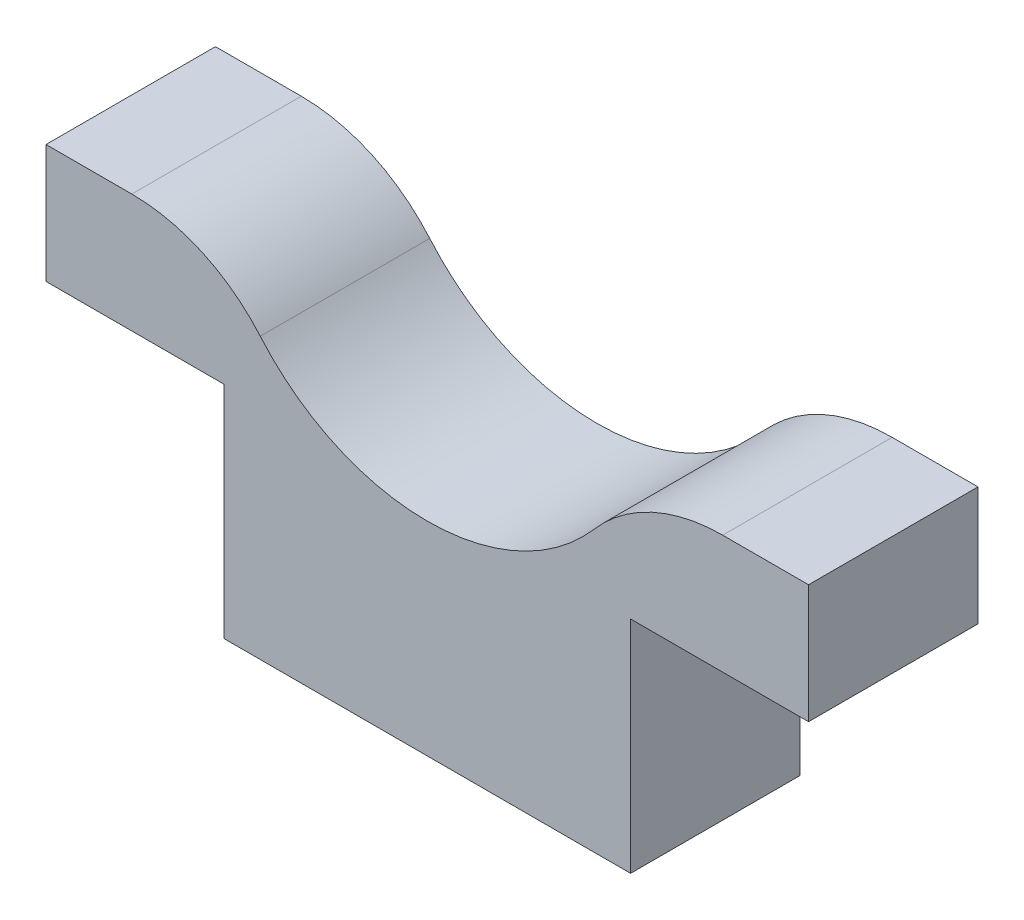
ISO-10303-21;
HEADER;
FILE_DESCRIPTION(('STEP AP214'),'2;1');
FILE_NAME('part.step','',(''),(''),'','','');
FILE_SCHEMA(('AUTOMOTIVE_DESIGN { 1 0 10303 214 1 1 1 1 }'));
ENDSEC;
DATA;
#1=APPLICATION_CONTEXT('core data for automotive mechanical design processes');
#2=APPLICATION_PROTOCOL_DEFINITION('international standard','automotive_design',2000,#1);
#3=PRODUCT_CONTEXT('',#1,'mechanical');
#4=PRODUCT('Part','Part','',(#3));
#5=PRODUCT_RELATED_PRODUCT_CATEGORY('part','',(#4));
#6=PRODUCT_DEFINITION_FORMATION('','',#4);
#7=PRODUCT_DEFINITION_CONTEXT('part definition',#1,'design');
#8=PRODUCT_DEFINITION('design','',#6,#7);
#9=PRODUCT_DEFINITION_SHAPE('','',#8);
#10=(LENGTH_UNIT() NAMED_UNIT(*) SI_UNIT(.MILLI.,.METRE.));
#11=(NAMED_UNIT(*) PLANE_ANGLE_UNIT() SI_UNIT($,.RADIAN.));
#12=(NAMED_UNIT(*) SI_UNIT($,.STERADIAN.) SOLID_ANGLE_UNIT());
#13=UNCERTAINTY_MEASURE_WITH_UNIT(LENGTH_MEASURE(1.E-05),#10,'distance_accuracy_value','');
#14=(GEOMETRIC_REPRESENTATION_CONTEXT(3) GLOBAL_UNCERTAINTY_ASSIGNED_CONTEXT((#13)) GLOBAL_UNIT_ASSIGNED_CONTEXT((#10,
#11,#12)) REPRESENTATION_CONTEXT('',''));
#15=CARTESIAN_POINT('',(0.,0.,0.));
#16=DIRECTION('',(0.,0.,1.));
#17=DIRECTION('',(1.,0.,0.));
#18=AXIS2_PLACEMENT_3D('',#15,#16,#17);
#19=CARTESIAN_POINT('',(0.,20.,10.));
#20=DIRECTION('',(0.,1.,0.));
#21=DIRECTION('',(0.,0.,1.));
#22=AXIS2_PLACEMENT_3D('',#19,#20,#21);
#23=PLANE('',#22);
#24=DIRECTION('',(1.,0.,0.));
#25=VECTOR('',#24,1.);
#26=CARTESIAN_POINT('',(0.,20.,0.));
#27=LINE('',#26,#25);
#28=CARTESIAN_POINT('',(29.4355957741627,20.,0.));
#29=VERTEX_POINT('',#28);
#30=CARTESIAN_POINT('',(34.5,20.,0.));
#31=VERTEX_POINT('',#30);
#32=EDGE_CURVE('E212',#29,#31,#27,.T.);
#33=ORIENTED_EDGE('',*,*,#32,.F.);
#34=DIRECTION('',(0.,0.,1.));
#35=VECTOR('',#34,1.);
#36=CARTESIAN_POINT('',(29.4355957741627,20.,10.));
#37=LINE('',#36,#35);
#38=CARTESIAN_POINT('',(29.4355957741627,20.,10.));
#39=VERTEX_POINT('',#38);
#40=EDGE_CURVE('E11',#29,#39,#37,.T.);
#41=ORIENTED_EDGE('',*,*,#40,.T.);
#42=DIRECTION('',(1.,0.,0.));
#43=VECTOR('',#42,1.);
#44=CARTESIAN_POINT('',(0.,20.,10.));
#45=LINE('',#44,#43);
#46=CARTESIAN_POINT('',(34.5,20.,10.));
#47=VERTEX_POINT('',#46);
#48=EDGE_CURVE('E181',#39,#47,#45,.T.);
#49=ORIENTED_EDGE('',*,*,#48,.T.);
#50=DIRECTION('',(0.,0.,-1.));
#51=VECTOR('',#50,1.);
#52=CARTESIAN_POINT('',(34.5,20.,10.));
#53=LINE('',#52,#51);
#54=EDGE_CURVE('E224',#47,#31,#53,.T.);
#55=ORIENTED_EDGE('',*,*,#54,.T.);
#56=EDGE_LOOP('',(#33,#41,#49,#55));
#57=FACE_BOUND('',#56,.T.);
#58=ADVANCED_FACE('F35',(#57),#23,.T.);
#59=CARTESIAN_POINT('',(0.,0.,10.));
#60=DIRECTION('',(0.,1.,0.));
#61=DIRECTION('',(0.,0.,1.));
#62=AXIS2_PLACEMENT_3D('',#59,#60,#61);
#63=PLANE('',#62);
#64=DIRECTION('',(1.,0.,0.));
#65=VECTOR('',#64,1.);
#66=CARTESIAN_POINT('',(0.,0.,0.));
#67=LINE('',#66,#65);
#68=CARTESIAN_POINT('',(0.,0.,0.));
#69=VERTEX_POINT('',#68);
#70=CARTESIAN_POINT('',(24.,0.,0.));
#71=VERTEX_POINT('',#70);
#72=EDGE_CURVE('E148',#69,#71,#67,.T.);
#73=ORIENTED_EDGE('',*,*,#72,.T.);
#74=DIRECTION('',(0.,0.,-1.));
#75=VECTOR('',#74,1.);
#76=CARTESIAN_POINT('',(24.,0.,10.));
#77=LINE('',#76,#75);
#78=CARTESIAN_POINT('',(24.,0.,10.));
#79=VERTEX_POINT('',#78);
#80=EDGE_CURVE('E129',#79,#71,#77,.T.);
#81=ORIENTED_EDGE('',*,*,#80,.F.);
#82=DIRECTION('',(1.,0.,0.));
#83=VECTOR('',#82,1.);
#84=CARTESIAN_POINT('',(0.,0.,10.));
#85=LINE('',#84,#83);
#86=CARTESIAN_POINT('',(0.,0.,10.));
#87=VERTEX_POINT('',#86);
#88=EDGE_CURVE('E136',#87,#79,#85,.T.);
#89=ORIENTED_EDGE('',*,*,#88,.F.);
#90=DIRECTION('',(0.,0.,-1.));
#91=VECTOR('',#90,1.);
#92=CARTESIAN_POINT('',(0.,0.,10.));
#93=LINE('',#92,#91);
#94=EDGE_CURVE('E202',#87,#69,#93,.T.);
#95=ORIENTED_EDGE('',*,*,#94,.T.);
#96=EDGE_LOOP('',(#73,#81,#89,#95));
#97=FACE_BOUND('',#96,.T.);
#98=ADVANCED_FACE('F146',(#97),#63,.F.);
#99=CARTESIAN_POINT('',(24.,0.,10.));
#100=DIRECTION('',(-1.,0.,0.));
#101=DIRECTION('',(0.,0.,1.));
#102=AXIS2_PLACEMENT_3D('',#99,#100,#101);
#103=PLANE('',#102);
#104=DIRECTION('',(0.,1.,0.));
#105=VECTOR('',#104,1.);
#106=CARTESIAN_POINT('',(24.,0.,0.));
#107=LINE('',#106,#105);
#108=CARTESIAN_POINT('',(24.,13.,0.));
#109=VERTEX_POINT('',#108);
#110=EDGE_CURVE('E204',#71,#109,#107,.T.);
#111=ORIENTED_EDGE('',*,*,#110,.T.);
#112=DIRECTION('',(0.,0.,-1.));
#113=VECTOR('',#112,1.);
#114=CARTESIAN_POINT('',(24.,13.,10.));
#115=LINE('',#114,#113);
#116=CARTESIAN_POINT('',(24.,13.,10.));
#117=VERTEX_POINT('',#116);
#118=EDGE_CURVE('E132',#117,#109,#115,.T.);
#119=ORIENTED_EDGE('',*,*,#118,.F.);
#120=DIRECTION('',(0.,1.,0.));
#121=VECTOR('',#120,1.);
#122=CARTESIAN_POINT('',(24.,0.,10.));
#123=LINE('',#122,#121);
#124=EDGE_CURVE('E125',#79,#117,#123,.T.);
#125=ORIENTED_EDGE('',*,*,#124,.F.);
#126=ORIENTED_EDGE('',*,*,#80,.T.);
#127=EDGE_LOOP('',(#111,#119,#125,#126));
#128=FACE_BOUND('',#127,.T.);
#129=ADVANCED_FACE('F127',(#128),#103,.F.);
#130=CARTESIAN_POINT('',(0.,13.,10.));
#131=DIRECTION('',(0.,1.,0.));
#132=DIRECTION('',(0.,0.,1.));
#133=AXIS2_PLACEMENT_3D('',#130,#131,#132);
#134=PLANE('',#133);
#135=DIRECTION('',(1.,0.,0.));
#136=VECTOR('',#135,1.);
#137=CARTESIAN_POINT('',(0.,13.,0.));
#138=LINE('',#137,#136);
#139=CARTESIAN_POINT('',(34.5,13.,0.));
#140=VERTEX_POINT('',#139);
#141=EDGE_CURVE('E206',#109,#140,#138,.T.);
#142=ORIENTED_EDGE('',*,*,#141,.T.);
#143=DIRECTION('',(0.,0.,-1.));
#144=VECTOR('',#143,1.);
#145=CARTESIAN_POINT('',(34.5,13.,10.));
#146=LINE('',#145,#144);
#147=CARTESIAN_POINT('',(34.5,13.,10.));
#148=VERTEX_POINT('',#147);
#149=EDGE_CURVE('E154',#148,#140,#146,.T.);
#150=ORIENTED_EDGE('',*,*,#149,.F.);
#151=DIRECTION('',(1.,0.,0.));
#152=VECTOR('',#151,1.);
#153=CARTESIAN_POINT('',(0.,13.,10.));
#154=LINE('',#153,#152);
#155=EDGE_CURVE('E135',#117,#148,#154,.T.);
#156=ORIENTED_EDGE('',*,*,#155,.F.);
#157=ORIENTED_EDGE('',*,*,#118,.T.);
#158=EDGE_LOOP('',(#142,#150,#156,#157));
#159=FACE_BOUND('',#158,.T.);
#160=ADVANCED_FACE('F236',(#159),#134,.F.);
#161=CARTESIAN_POINT('',(34.5,0.,10.));
#162=DIRECTION('',(-1.,0.,0.));
#163=DIRECTION('',(0.,0.,1.));
#164=AXIS2_PLACEMENT_3D('',#161,#162,#163);
#165=PLANE('',#164);
#166=DIRECTION('',(0.,1.,0.));
#167=VECTOR('',#166,1.);
#168=CARTESIAN_POINT('',(34.5,0.,0.));
#169=LINE('',#168,#167);
#170=EDGE_CURVE('E208',#140,#31,#169,.T.);
#171=ORIENTED_EDGE('',*,*,#170,.T.);
#172=ORIENTED_EDGE('',*,*,#54,.F.);
#173=DIRECTION('',(0.,1.,0.));
#174=VECTOR('',#173,1.);
#175=CARTESIAN_POINT('',(34.5,0.,10.));
#176=LINE('',#175,#174);
#177=EDGE_CURVE('E196',#148,#47,#176,.T.);
#178=ORIENTED_EDGE('',*,*,#177,.F.);
#179=ORIENTED_EDGE('',*,*,#149,.T.);
#180=EDGE_LOOP('',(#171,#172,#178,#179));
#181=FACE_BOUND('',#180,.T.);
#182=ADVANCED_FACE('F231',(#181),#165,.F.);
#183=CARTESIAN_POINT('',(-10.5,20.,10.));
#184=VERTEX_POINT('',#183);
#185=CARTESIAN_POINT('',(-5.43559577416268,20.,10.));
#186=VERTEX_POINT('',#185);
#187=EDGE_CURVE('E170',#184,#186,#45,.T.);
#188=ORIENTED_EDGE('',*,*,#187,.T.);
#189=DIRECTION('',(0.,0.,1.));
#190=VECTOR('',#189,1.);
#191=CARTESIAN_POINT('',(-5.43559577416268,20.,0.));
#192=LINE('',#191,#190);
#193=CARTESIAN_POINT('',(-5.43559577416268,20.,0.));
#194=VERTEX_POINT('',#193);
#195=EDGE_CURVE('E149',#186,#194,#192,.F.);
#196=ORIENTED_EDGE('',*,*,#195,.T.);
#197=CARTESIAN_POINT('',(-10.5,20.,0.));
#198=VERTEX_POINT('',#197);
#199=EDGE_CURVE('E189',#198,#194,#27,.T.);
#200=ORIENTED_EDGE('',*,*,#199,.F.);
#201=DIRECTION('',(0.,0.,-1.));
#202=VECTOR('',#201,1.);
#203=CARTESIAN_POINT('',(-10.5,20.,10.));
#204=LINE('',#203,#202);
#205=EDGE_CURVE('E179',#184,#198,#204,.T.);
#206=ORIENTED_EDGE('',*,*,#205,.F.);
#207=EDGE_LOOP('',(#188,#196,#200,#206));
#208=FACE_BOUND('',#207,.T.);
#209=ADVANCED_FACE('F176',(#208),#23,.T.);
#210=CARTESIAN_POINT('',(-10.5,0.,10.));
#211=DIRECTION('',(-1.,0.,0.));
#212=DIRECTION('',(0.,-1.,0.));
#213=AXIS2_PLACEMENT_3D('',#210,#211,#212);
#214=PLANE('',#213);
#215=DIRECTION('',(0.,1.,0.));
#216=VECTOR('',#215,1.);
#217=CARTESIAN_POINT('',(-10.5,0.,0.));
#218=LINE('',#217,#216);
#219=CARTESIAN_POINT('',(-10.5,13.,0.));
#220=VERTEX_POINT('',#219);
#221=EDGE_CURVE('E214',#220,#198,#218,.T.);
#222=ORIENTED_EDGE('',*,*,#221,.F.);
#223=DIRECTION('',(0.,0.,-1.));
#224=VECTOR('',#223,1.);
#225=CARTESIAN_POINT('',(-10.5,13.,10.));
#226=LINE('',#225,#224);
#227=CARTESIAN_POINT('',(-10.5,13.,10.));
#228=VERTEX_POINT('',#227);
#229=EDGE_CURVE('E221',#228,#220,#226,.T.);
#230=ORIENTED_EDGE('',*,*,#229,.F.);
#231=DIRECTION('',(0.,1.,0.));
#232=VECTOR('',#231,1.);
#233=CARTESIAN_POINT('',(-10.5,0.,10.));
#234=LINE('',#233,#232);
#235=EDGE_CURVE('E180',#228,#184,#234,.T.);
#236=ORIENTED_EDGE('',*,*,#235,.T.);
#237=ORIENTED_EDGE('',*,*,#205,.T.);
#238=EDGE_LOOP('',(#222,#230,#236,#237));
#239=FACE_BOUND('',#238,.T.);
#240=ADVANCED_FACE('F250',(#239),#214,.T.);
#241=CARTESIAN_POINT('',(0.,13.,0.));
#242=VERTEX_POINT('',#241);
#243=EDGE_CURVE('E209',#220,#242,#138,.T.);
#244=ORIENTED_EDGE('',*,*,#243,.T.);
#245=DIRECTION('',(0.,0.,-1.));
#246=VECTOR('',#245,1.);
#247=CARTESIAN_POINT('',(0.,13.,10.));
#248=LINE('',#247,#246);
#249=CARTESIAN_POINT('',(0.,13.,10.));
#250=VERTEX_POINT('',#249);
#251=EDGE_CURVE('E219',#250,#242,#248,.T.);
#252=ORIENTED_EDGE('',*,*,#251,.F.);
#253=EDGE_CURVE('E197',#228,#250,#154,.T.);
#254=ORIENTED_EDGE('',*,*,#253,.F.);
#255=ORIENTED_EDGE('',*,*,#229,.T.);
#256=EDGE_LOOP('',(#244,#252,#254,#255));
#257=FACE_BOUND('',#256,.T.);
#258=ADVANCED_FACE('F239',(#257),#134,.F.);
#259=CARTESIAN_POINT('',(0.,0.,10.));
#260=DIRECTION('',(-1.,0.,0.));
#261=DIRECTION('',(0.,0.,1.));
#262=AXIS2_PLACEMENT_3D('',#259,#260,#261);
#263=PLANE('',#262);
#264=DIRECTION('',(0.,1.,0.));
#265=VECTOR('',#264,1.);
#266=CARTESIAN_POINT('',(0.,0.,0.));
#267=LINE('',#266,#265);
#268=EDGE_CURVE('E144',#69,#242,#267,.T.);
#269=ORIENTED_EDGE('',*,*,#268,.F.);
#270=ORIENTED_EDGE('',*,*,#94,.F.);
#271=DIRECTION('',(0.,1.,0.));
#272=VECTOR('',#271,1.);
#273=CARTESIAN_POINT('',(0.,0.,10.));
#274=LINE('',#273,#272);
#275=EDGE_CURVE('E142',#87,#250,#274,.T.);
#276=ORIENTED_EDGE('',*,*,#275,.T.);
#277=ORIENTED_EDGE('',*,*,#251,.T.);
#278=EDGE_LOOP('',(#269,#270,#276,#277));
#279=FACE_BOUND('',#278,.T.);
#280=ADVANCED_FACE('F249',(#279),#263,.T.);
#281=CARTESIAN_POINT('',(0.,0.,10.));
#282=DIRECTION('',(0.,0.,1.));
#283=DIRECTION('',(1.,0.,0.));
#284=AXIS2_PLACEMENT_3D('',#281,#282,#283);
#285=PLANE('',#284);
#286=CARTESIAN_POINT('',(12.,25.,10.));
#287=DIRECTION('',(0.,0.,-1.));
#288=DIRECTION('',(1.,0.,0.));
#289=AXIS2_PLACEMENT_3D('',#286,#287,#288);
#290=CIRCLE('',#289,13.);
#291=CARTESIAN_POINT('',(21.8549019593094,16.5217391304348,10.));
#292=VERTEX_POINT('',#291);
#293=CARTESIAN_POINT('',(2.14509804069066,16.5217391304348,10.));
#294=VERTEX_POINT('',#293);
#295=EDGE_CURVE('E172',#292,#294,#290,.T.);
#296=ORIENTED_EDGE('',*,*,#295,.T.);
#297=CARTESIAN_POINT('',(-5.43559577416268,10.,10.));
#298=DIRECTION('',(0.,0.,1.));
#299=DIRECTION('',(1.,0.,0.));
#300=AXIS2_PLACEMENT_3D('',#297,#298,#299);
#301=CIRCLE('',#300,10.);
#302=EDGE_CURVE('E43',#294,#186,#301,.T.);
#303=ORIENTED_EDGE('',*,*,#302,.T.);
#304=ORIENTED_EDGE('',*,*,#187,.F.);
#305=ORIENTED_EDGE('',*,*,#235,.F.);
#306=ORIENTED_EDGE('',*,*,#253,.T.);
#307=ORIENTED_EDGE('',*,*,#275,.F.);
#308=ORIENTED_EDGE('',*,*,#88,.T.);
#309=ORIENTED_EDGE('',*,*,#124,.T.);
#310=ORIENTED_EDGE('',*,*,#155,.T.);
#311=ORIENTED_EDGE('',*,*,#177,.T.);
#312=ORIENTED_EDGE('',*,*,#48,.F.);
#313=CARTESIAN_POINT('',(29.4355957741627,10.,10.));
#314=DIRECTION('',(0.,0.,1.));
#315=DIRECTION('',(1.,0.,0.));
#316=AXIS2_PLACEMENT_3D('',#313,#314,#315);
#317=CIRCLE('',#316,10.);
#318=EDGE_CURVE('E165',#39,#292,#317,.T.);
#319=ORIENTED_EDGE('',*,*,#318,.T.);
#320=EDGE_LOOP('',(#296,#303,#304,#305,#306,#307,#308,#309,#310,#311,#312,#319));
#321=FACE_BOUND('',#320,.T.);
#322=ADVANCED_FACE('F140',(#321),#285,.T.);
#323=CARTESIAN_POINT('',(0.,0.,0.));
#324=DIRECTION('',(0.,0.,1.));
#325=DIRECTION('',(1.,0.,0.));
#326=AXIS2_PLACEMENT_3D('',#323,#324,#325);
#327=PLANE('',#326);
#328=ORIENTED_EDGE('',*,*,#199,.T.);
#329=CARTESIAN_POINT('',(-5.43559577416268,10.,0.));
#330=DIRECTION('',(0.,0.,1.));
#331=DIRECTION('',(1.,0.,0.));
#332=AXIS2_PLACEMENT_3D('',#329,#330,#331);
#333=CIRCLE('',#332,10.);
#334=CARTESIAN_POINT('',(2.14509804069066,16.5217391304348,0.));
#335=VERTEX_POINT('',#334);
#336=EDGE_CURVE('E159',#194,#335,#333,.F.);
#337=ORIENTED_EDGE('',*,*,#336,.T.);
#338=CARTESIAN_POINT('',(12.,25.,0.));
#339=DIRECTION('',(0.,0.,-1.));
#340=DIRECTION('',(1.,0.,0.));
#341=AXIS2_PLACEMENT_3D('',#338,#339,#340);
#342=CIRCLE('',#341,13.);
#343=CARTESIAN_POINT('',(21.8549019593094,16.5217391304348,0.));
#344=VERTEX_POINT('',#343);
#345=EDGE_CURVE('E187',#344,#335,#342,.T.);
#346=ORIENTED_EDGE('',*,*,#345,.F.);
#347=CARTESIAN_POINT('',(29.4355957741627,10.,0.));
#348=DIRECTION('',(0.,0.,1.));
#349=DIRECTION('',(1.,0.,0.));
#350=AXIS2_PLACEMENT_3D('',#347,#348,#349);
#351=CIRCLE('',#350,10.);
#352=EDGE_CURVE('E152',#344,#29,#351,.F.);
#353=ORIENTED_EDGE('',*,*,#352,.T.);
#354=ORIENTED_EDGE('',*,*,#32,.T.);
#355=ORIENTED_EDGE('',*,*,#170,.F.);
#356=ORIENTED_EDGE('',*,*,#141,.F.);
#357=ORIENTED_EDGE('',*,*,#110,.F.);
#358=ORIENTED_EDGE('',*,*,#72,.F.);
#359=ORIENTED_EDGE('',*,*,#268,.T.);
#360=ORIENTED_EDGE('',*,*,#243,.F.);
#361=ORIENTED_EDGE('',*,*,#221,.T.);
#362=EDGE_LOOP('',(#328,#337,#346,#353,#354,#355,#356,#357,#358,#359,#360,#361));
#363=FACE_BOUND('',#362,.T.);
#364=ADVANCED_FACE('F186',(#363),#327,.F.);
#365=CARTESIAN_POINT('',(12.,25.,10.));
#366=DIRECTION('',(0.,0.,-1.));
#367=DIRECTION('',(-1.,0.,0.));
#368=AXIS2_PLACEMENT_3D('',#365,#366,#367);
#369=CYLINDRICAL_SURFACE('',#368,13.);
#370=ORIENTED_EDGE('',*,*,#345,.T.);
#371=DIRECTION('',(0.,0.,-1.));
#372=VECTOR('',#371,1.);
#373=CARTESIAN_POINT('',(2.14509804069066,16.5217391304348,10.));
#374=LINE('',#373,#372);
#375=EDGE_CURVE('E56',#335,#294,#374,.F.);
#376=ORIENTED_EDGE('',*,*,#375,.T.);
#377=ORIENTED_EDGE('',*,*,#295,.F.);
#378=DIRECTION('',(0.,0.,-1.));
#379=VECTOR('',#378,1.);
#380=CARTESIAN_POINT('',(21.8549019593094,16.5217391304348,10.));
#381=LINE('',#380,#379);
#382=EDGE_CURVE('E161',#292,#344,#381,.T.);
#383=ORIENTED_EDGE('',*,*,#382,.T.);
#384=EDGE_LOOP('',(#370,#376,#377,#383));
#385=FACE_BOUND('',#384,.T.);
#386=ADVANCED_FACE('F190',(#385),#369,.F.);
#387=CARTESIAN_POINT('',(-5.43559577416268,10.,10.));
#388=DIRECTION('',(0.,0.,-1.));
#389=DIRECTION('',(-1.,0.,0.));
#390=AXIS2_PLACEMENT_3D('',#387,#388,#389);
#391=CYLINDRICAL_SURFACE('',#390,10.);
#392=ORIENTED_EDGE('',*,*,#302,.F.);
#393=ORIENTED_EDGE('',*,*,#375,.F.);
#394=ORIENTED_EDGE('',*,*,#336,.F.);
#395=ORIENTED_EDGE('',*,*,#195,.F.);
#396=EDGE_LOOP('',(#392,#393,#394,#395));
#397=FACE_BOUND('',#396,.T.);
#398=ADVANCED_FACE('F183',(#397),#391,.T.);
#399=CARTESIAN_POINT('',(29.4355957741627,10.,10.));
#400=DIRECTION('',(0.,0.,-1.));
#401=DIRECTION('',(-1.,0.,0.));
#402=AXIS2_PLACEMENT_3D('',#399,#400,#401);
#403=CYLINDRICAL_SURFACE('',#402,10.);
#404=ORIENTED_EDGE('',*,*,#318,.F.);
#405=ORIENTED_EDGE('',*,*,#40,.F.);
#406=ORIENTED_EDGE('',*,*,#352,.F.);
#407=ORIENTED_EDGE('',*,*,#382,.F.);
#408=EDGE_LOOP('',(#404,#405,#406,#407));
#409=FACE_BOUND('',#408,.T.);
#410=ADVANCED_FACE('F37',(#409),#403,.T.);
#411=CLOSED_SHELL('',(#58,#98,#129,#160,#182,#209,#240,#258,#280,#322,#364,#386,#398,#410));
#412=MANIFOLD_SOLID_BREP('B2',#411);
#413=ADVANCED_BREP_SHAPE_REPRESENTATION('',(#18,#412),#14);
#414=SHAPE_DEFINITION_REPRESENTATION(#9,#413);
ENDSEC;
END-ISO-10303-21;
